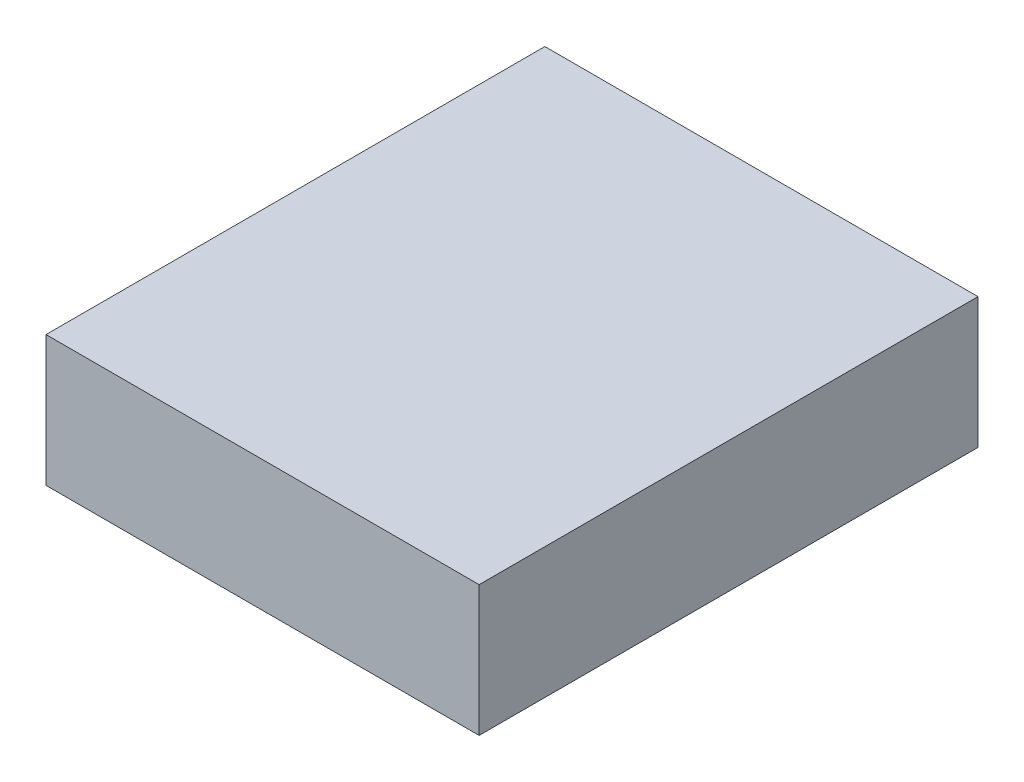
ISO-10303-21;
HEADER;
FILE_DESCRIPTION(('STEP AP214'),'2;1');
FILE_NAME('part.step','',(''),(''),'','','');
FILE_SCHEMA(('AUTOMOTIVE_DESIGN { 1 0 10303 214 1 1 1 1 }'));
ENDSEC;
DATA;
#1=APPLICATION_CONTEXT('core data for automotive mechanical design processes');
#2=APPLICATION_PROTOCOL_DEFINITION('international standard','automotive_design',2000,#1);
#3=PRODUCT_CONTEXT('',#1,'mechanical');
#4=PRODUCT('Part','Part','',(#3));
#5=PRODUCT_RELATED_PRODUCT_CATEGORY('part','',(#4));
#6=PRODUCT_DEFINITION_FORMATION('','',#4);
#7=PRODUCT_DEFINITION_CONTEXT('part definition',#1,'design');
#8=PRODUCT_DEFINITION('design','',#6,#7);
#9=PRODUCT_DEFINITION_SHAPE('','',#8);
#10=(LENGTH_UNIT() NAMED_UNIT(*) SI_UNIT(.MILLI.,.METRE.));
#11=(NAMED_UNIT(*) PLANE_ANGLE_UNIT() SI_UNIT($,.RADIAN.));
#12=(NAMED_UNIT(*) SI_UNIT($,.STERADIAN.) SOLID_ANGLE_UNIT());
#13=UNCERTAINTY_MEASURE_WITH_UNIT(LENGTH_MEASURE(1.E-05),#10,'distance_accuracy_value','');
#14=(GEOMETRIC_REPRESENTATION_CONTEXT(3) GLOBAL_UNCERTAINTY_ASSIGNED_CONTEXT((#13)) GLOBAL_UNIT_ASSIGNED_CONTEXT((#10,
#11,#12)) REPRESENTATION_CONTEXT('',''));
#15=CARTESIAN_POINT('',(0.,0.,0.));
#16=DIRECTION('',(0.,0.,1.));
#17=DIRECTION('',(1.,0.,0.));
#18=AXIS2_PLACEMENT_3D('',#15,#16,#17);
#19=CARTESIAN_POINT('',(0.,19.685,0.));
#20=DIRECTION('',(1.,0.,0.));
#21=DIRECTION('',(0.,0.,-1.));
#22=AXIS2_PLACEMENT_3D('',#19,#20,#21);
#23=PLANE('',#22);
#24=DIRECTION('',(0.,0.,1.));
#25=VECTOR('',#24,1.);
#26=CARTESIAN_POINT('',(0.,0.,0.));
#27=LINE('',#26,#25);
#28=CARTESIAN_POINT('',(0.,0.,-75.184));
#29=VERTEX_POINT('',#28);
#30=CARTESIAN_POINT('',(0.,0.,0.));
#31=VERTEX_POINT('',#30);
#32=EDGE_CURVE('E96',#29,#31,#27,.T.);
#33=ORIENTED_EDGE('',*,*,#32,.T.);
#34=DIRECTION('',(0.,-1.,0.));
#35=VECTOR('',#34,1.);
#36=CARTESIAN_POINT('',(0.,19.685,0.));
#37=LINE('',#36,#35);
#38=CARTESIAN_POINT('',(0.,19.685,0.));
#39=VERTEX_POINT('',#38);
#40=EDGE_CURVE('E11',#39,#31,#37,.T.);
#41=ORIENTED_EDGE('',*,*,#40,.F.);
#42=DIRECTION('',(0.,0.,1.));
#43=VECTOR('',#42,1.);
#44=CARTESIAN_POINT('',(0.,19.685,0.));
#45=LINE('',#44,#43);
#46=CARTESIAN_POINT('',(0.,19.685,-75.184));
#47=VERTEX_POINT('',#46);
#48=EDGE_CURVE('E84',#47,#39,#45,.T.);
#49=ORIENTED_EDGE('',*,*,#48,.F.);
#50=DIRECTION('',(0.,-1.,0.));
#51=VECTOR('',#50,1.);
#52=CARTESIAN_POINT('',(0.,19.685,-75.184));
#53=LINE('',#52,#51);
#54=EDGE_CURVE('E92',#47,#29,#53,.T.);
#55=ORIENTED_EDGE('',*,*,#54,.T.);
#56=EDGE_LOOP('',(#33,#41,#49,#55));
#57=FACE_BOUND('',#56,.T.);
#58=ADVANCED_FACE('F33',(#57),#23,.F.);
#59=CARTESIAN_POINT('',(0.,19.685,0.));
#60=DIRECTION('',(0.,0.,-1.));
#61=DIRECTION('',(-1.,0.,0.));
#62=AXIS2_PLACEMENT_3D('',#59,#60,#61);
#63=PLANE('',#62);
#64=DIRECTION('',(1.,0.,0.));
#65=VECTOR('',#64,1.);
#66=CARTESIAN_POINT('',(0.,0.,0.));
#67=LINE('',#66,#65);
#68=CARTESIAN_POINT('',(65.278,0.,0.));
#69=VERTEX_POINT('',#68);
#70=EDGE_CURVE('E88',#31,#69,#67,.T.);
#71=ORIENTED_EDGE('',*,*,#70,.T.);
#72=DIRECTION('',(0.,-1.,0.));
#73=VECTOR('',#72,1.);
#74=CARTESIAN_POINT('',(65.278,19.685,0.));
#75=LINE('',#74,#73);
#76=CARTESIAN_POINT('',(65.278,19.685,0.));
#77=VERTEX_POINT('',#76);
#78=EDGE_CURVE('E41',#77,#69,#75,.T.);
#79=ORIENTED_EDGE('',*,*,#78,.F.);
#80=DIRECTION('',(1.,0.,0.));
#81=VECTOR('',#80,1.);
#82=CARTESIAN_POINT('',(0.,19.685,0.));
#83=LINE('',#82,#81);
#84=EDGE_CURVE('E79',#39,#77,#83,.T.);
#85=ORIENTED_EDGE('',*,*,#84,.F.);
#86=ORIENTED_EDGE('',*,*,#40,.T.);
#87=EDGE_LOOP('',(#71,#79,#85,#86));
#88=FACE_BOUND('',#87,.T.);
#89=ADVANCED_FACE('F87',(#88),#63,.F.);
#90=CARTESIAN_POINT('',(65.278,19.685,0.));
#91=DIRECTION('',(-1.,0.,0.));
#92=DIRECTION('',(0.,0.,1.));
#93=AXIS2_PLACEMENT_3D('',#90,#91,#92);
#94=PLANE('',#93);
#95=DIRECTION('',(0.,0.,-1.));
#96=VECTOR('',#95,1.);
#97=CARTESIAN_POINT('',(65.278,0.,0.));
#98=LINE('',#97,#96);
#99=CARTESIAN_POINT('',(65.278,0.,-75.184));
#100=VERTEX_POINT('',#99);
#101=EDGE_CURVE('E66',#69,#100,#98,.T.);
#102=ORIENTED_EDGE('',*,*,#101,.T.);
#103=DIRECTION('',(0.,-1.,0.));
#104=VECTOR('',#103,1.);
#105=CARTESIAN_POINT('',(65.278,19.685,-75.184));
#106=LINE('',#105,#104);
#107=CARTESIAN_POINT('',(65.278,19.685,-75.184));
#108=VERTEX_POINT('',#107);
#109=EDGE_CURVE('E89',#108,#100,#106,.T.);
#110=ORIENTED_EDGE('',*,*,#109,.F.);
#111=DIRECTION('',(0.,0.,-1.));
#112=VECTOR('',#111,1.);
#113=CARTESIAN_POINT('',(65.278,19.685,0.));
#114=LINE('',#113,#112);
#115=EDGE_CURVE('E82',#77,#108,#114,.T.);
#116=ORIENTED_EDGE('',*,*,#115,.F.);
#117=ORIENTED_EDGE('',*,*,#78,.T.);
#118=EDGE_LOOP('',(#102,#110,#116,#117));
#119=FACE_BOUND('',#118,.T.);
#120=ADVANCED_FACE('F90',(#119),#94,.F.);
#121=CARTESIAN_POINT('',(0.,19.685,-75.184));
#122=DIRECTION('',(0.,0.,1.));
#123=DIRECTION('',(1.,0.,0.));
#124=AXIS2_PLACEMENT_3D('',#121,#122,#123);
#125=PLANE('',#124);
#126=DIRECTION('',(-1.,0.,0.));
#127=VECTOR('',#126,1.);
#128=CARTESIAN_POINT('',(0.,0.,-75.184));
#129=LINE('',#128,#127);
#130=EDGE_CURVE('E72',#100,#29,#129,.T.);
#131=ORIENTED_EDGE('',*,*,#130,.T.);
#132=ORIENTED_EDGE('',*,*,#54,.F.);
#133=DIRECTION('',(-1.,0.,0.));
#134=VECTOR('',#133,1.);
#135=CARTESIAN_POINT('',(0.,19.685,-75.184));
#136=LINE('',#135,#134);
#137=EDGE_CURVE('E49',#108,#47,#136,.T.);
#138=ORIENTED_EDGE('',*,*,#137,.F.);
#139=ORIENTED_EDGE('',*,*,#109,.T.);
#140=EDGE_LOOP('',(#131,#132,#138,#139));
#141=FACE_BOUND('',#140,.T.);
#142=ADVANCED_FACE('F104',(#141),#125,.F.);
#143=CARTESIAN_POINT('',(0.,19.685,0.));
#144=DIRECTION('',(0.,-1.,0.));
#145=DIRECTION('',(0.,0.,-1.));
#146=AXIS2_PLACEMENT_3D('',#143,#144,#145);
#147=PLANE('',#146);
#148=ORIENTED_EDGE('',*,*,#48,.T.);
#149=ORIENTED_EDGE('',*,*,#84,.T.);
#150=ORIENTED_EDGE('',*,*,#115,.T.);
#151=ORIENTED_EDGE('',*,*,#137,.T.);
#152=EDGE_LOOP('',(#148,#149,#150,#151));
#153=FACE_BOUND('',#152,.T.);
#154=ADVANCED_FACE('F80',(#153),#147,.F.);
#155=CARTESIAN_POINT('',(0.,0.,0.));
#156=DIRECTION('',(0.,-1.,0.));
#157=DIRECTION('',(0.,0.,-1.));
#158=AXIS2_PLACEMENT_3D('',#155,#156,#157);
#159=PLANE('',#158);
#160=CARTESIAN_POINT('',(16.51,0.,-6.604));
#161=DIRECTION('',(0.,-1.,0.));
#162=DIRECTION('',(0.,0.,-1.));
#163=AXIS2_PLACEMENT_3D('',#160,#161,#162);
#164=CIRCLE('',#163,2.54);
#165=CARTESIAN_POINT('',(16.51,0.,-9.144));
#166=VERTEX_POINT('',#165);
#167=EDGE_CURVE('E110',#166,#166,#164,.T.);
#168=ORIENTED_EDGE('',*,*,#167,.F.);
#169=EDGE_LOOP('',(#168));
#170=FACE_BOUND('',#169,.T.);
#171=ORIENTED_EDGE('',*,*,#32,.F.);
#172=ORIENTED_EDGE('',*,*,#130,.F.);
#173=ORIENTED_EDGE('',*,*,#101,.F.);
#174=ORIENTED_EDGE('',*,*,#70,.F.);
#175=EDGE_LOOP('',(#171,#172,#173,#174));
#176=FACE_BOUND('',#175,.T.);
#177=ADVANCED_FACE('F107',(#170,#176),#159,.T.);
#178=CARTESIAN_POINT('',(16.51,-3.302,-6.604));
#179=DIRECTION('',(0.,1.,0.));
#180=DIRECTION('',(0.,0.,1.));
#181=AXIS2_PLACEMENT_3D('',#178,#179,#180);
#182=CYLINDRICAL_SURFACE('',#181,2.54);
#183=CARTESIAN_POINT('',(16.51,-3.302,-6.604));
#184=DIRECTION('',(0.,-1.,0.));
#185=DIRECTION('',(0.,0.,-1.));
#186=AXIS2_PLACEMENT_3D('',#183,#184,#185);
#187=CIRCLE('',#186,2.54);
#188=CARTESIAN_POINT('',(16.51,-3.302,-9.144));
#189=VERTEX_POINT('',#188);
#190=EDGE_CURVE('E99',#189,#189,#187,.T.);
#191=ORIENTED_EDGE('',*,*,#190,.F.);
#192=EDGE_LOOP('',(#191));
#193=FACE_BOUND('',#192,.T.);
#194=ORIENTED_EDGE('',*,*,#167,.T.);
#195=EDGE_LOOP('',(#194));
#196=FACE_BOUND('',#195,.T.);
#197=ADVANCED_FACE('F118',(#193,#196),#182,.T.);
#198=CARTESIAN_POINT('',(16.51,-3.302,-6.604));
#199=DIRECTION('',(0.,-1.,0.));
#200=DIRECTION('',(0.,0.,-1.));
#201=AXIS2_PLACEMENT_3D('',#198,#199,#200);
#202=PLANE('',#201);
#203=ORIENTED_EDGE('',*,*,#190,.T.);
#204=EDGE_LOOP('',(#203));
#205=FACE_BOUND('',#204,.T.);
#206=ADVANCED_FACE('F116',(#205),#202,.T.);
#207=CLOSED_SHELL('',(#58,#89,#120,#142,#154,#177,#197,#206));
#208=MANIFOLD_SOLID_BREP('B2',#207);
#209=ADVANCED_BREP_SHAPE_REPRESENTATION('',(#18,#208),#14);
#210=SHAPE_DEFINITION_REPRESENTATION(#9,#209);
ENDSEC;
END-ISO-10303-21;
